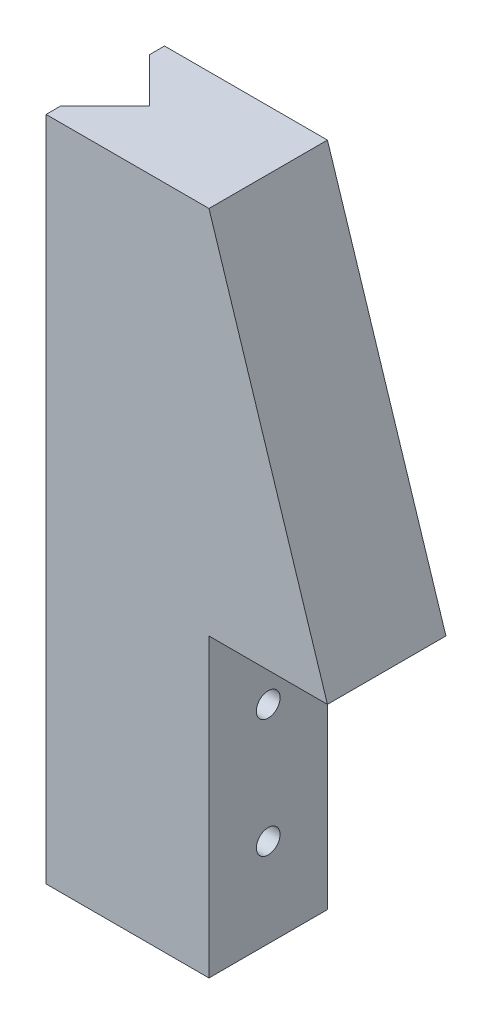
ISO-10303-21;
HEADER;
FILE_DESCRIPTION(('STEP AP214'),'2;1');
FILE_NAME('part.step','',(''),(''),'','','');
FILE_SCHEMA(('AUTOMOTIVE_DESIGN { 1 0 10303 214 1 1 1 1 }'));
ENDSEC;
DATA;
#1=APPLICATION_CONTEXT('core data for automotive mechanical design processes');
#2=APPLICATION_PROTOCOL_DEFINITION('international standard','automotive_design',2000,#1);
#3=PRODUCT_CONTEXT('',#1,'mechanical');
#4=PRODUCT('Part','Part','',(#3));
#5=PRODUCT_RELATED_PRODUCT_CATEGORY('part','',(#4));
#6=PRODUCT_DEFINITION_FORMATION('','',#4);
#7=PRODUCT_DEFINITION_CONTEXT('part definition',#1,'design');
#8=PRODUCT_DEFINITION('design','',#6,#7);
#9=PRODUCT_DEFINITION_SHAPE('','',#8);
#10=(LENGTH_UNIT() NAMED_UNIT(*) SI_UNIT(.MILLI.,.METRE.));
#11=(NAMED_UNIT(*) PLANE_ANGLE_UNIT() SI_UNIT($,.RADIAN.));
#12=(NAMED_UNIT(*) SI_UNIT($,.STERADIAN.) SOLID_ANGLE_UNIT());
#13=UNCERTAINTY_MEASURE_WITH_UNIT(LENGTH_MEASURE(1.E-05),#10,'distance_accuracy_value','');
#14=(GEOMETRIC_REPRESENTATION_CONTEXT(3) GLOBAL_UNCERTAINTY_ASSIGNED_CONTEXT((#13)) GLOBAL_UNIT_ASSIGNED_CONTEXT((#10,
#11,#12)) REPRESENTATION_CONTEXT('',''));
#15=CARTESIAN_POINT('',(0.,0.,0.));
#16=DIRECTION('',(0.,0.,1.));
#17=DIRECTION('',(1.,0.,0.));
#18=AXIS2_PLACEMENT_3D('',#15,#16,#17);
#19=CARTESIAN_POINT('',(-19.,-20.,8.));
#20=DIRECTION('',(1.,0.,0.));
#21=DIRECTION('',(0.,0.,-1.));
#22=AXIS2_PLACEMENT_3D('',#19,#20,#21);
#23=PLANE('',#22);
#24=DIRECTION('',(0.,0.,-1.));
#25=VECTOR('',#24,1.);
#26=CARTESIAN_POINT('',(-19.,-20.,8.));
#27=LINE('',#26,#25);
#28=CARTESIAN_POINT('',(-19.,-20.,1.));
#29=VERTEX_POINT('',#28);
#30=CARTESIAN_POINT('',(-19.,-20.,0.));
#31=VERTEX_POINT('',#30);
#32=EDGE_CURVE('E127',#29,#31,#27,.T.);
#33=ORIENTED_EDGE('',*,*,#32,.F.);
#34=DIRECTION('',(0.,1.,0.));
#35=VECTOR('',#34,1.);
#36=CARTESIAN_POINT('',(-19.,-20.,1.));
#37=LINE('',#36,#35);
#38=CARTESIAN_POINT('',(-19.,25.,1.));
#39=VERTEX_POINT('',#38);
#40=EDGE_CURVE('E140',#29,#39,#37,.T.);
#41=ORIENTED_EDGE('',*,*,#40,.T.);
#42=DIRECTION('',(0.,0.,-1.));
#43=VECTOR('',#42,1.);
#44=CARTESIAN_POINT('',(-19.,25.,8.));
#45=LINE('',#44,#43);
#46=CARTESIAN_POINT('',(-19.,25.,0.));
#47=VERTEX_POINT('',#46);
#48=EDGE_CURVE('E154',#39,#47,#45,.T.);
#49=ORIENTED_EDGE('',*,*,#48,.T.);
#50=DIRECTION('',(0.,-1.,0.));
#51=VECTOR('',#50,1.);
#52=CARTESIAN_POINT('',(-19.,-20.,0.));
#53=LINE('',#52,#51);
#54=EDGE_CURVE('E143',#47,#31,#53,.T.);
#55=ORIENTED_EDGE('',*,*,#54,.T.);
#56=EDGE_LOOP('',(#33,#41,#49,#55));
#57=FACE_BOUND('',#56,.T.);
#58=ADVANCED_FACE('F38',(#57),#23,.F.);
#59=CARTESIAN_POINT('',(-8.,25.,8.));
#60=DIRECTION('',(-0.952424147199324,-0.304775727103784,0.));
#61=DIRECTION('',(0.304775727103784,-0.952424147199324,0.));
#62=AXIS2_PLACEMENT_3D('',#59,#60,#61);
#63=PLANE('',#62);
#64=DIRECTION('',(-0.304775727103784,0.952424147199324,0.));
#65=VECTOR('',#64,1.);
#66=CARTESIAN_POINT('',(-8.,25.,0.));
#67=LINE('',#66,#65);
#68=CARTESIAN_POINT('',(0.,0.,0.));
#69=VERTEX_POINT('',#68);
#70=CARTESIAN_POINT('',(-8.,25.,0.));
#71=VERTEX_POINT('',#70);
#72=EDGE_CURVE('E136',#69,#71,#67,.T.);
#73=ORIENTED_EDGE('',*,*,#72,.T.);
#74=DIRECTION('',(0.,0.,-1.));
#75=VECTOR('',#74,1.);
#76=CARTESIAN_POINT('',(-8.,25.,8.));
#77=LINE('',#76,#75);
#78=CARTESIAN_POINT('',(-8.,25.,8.));
#79=VERTEX_POINT('',#78);
#80=EDGE_CURVE('E11',#79,#71,#77,.T.);
#81=ORIENTED_EDGE('',*,*,#80,.F.);
#82=DIRECTION('',(-0.304775727103784,0.952424147199324,0.));
#83=VECTOR('',#82,1.);
#84=CARTESIAN_POINT('',(-8.,25.,8.));
#85=LINE('',#84,#83);
#86=CARTESIAN_POINT('',(0.,0.,8.));
#87=VERTEX_POINT('',#86);
#88=EDGE_CURVE('E150',#87,#79,#85,.T.);
#89=ORIENTED_EDGE('',*,*,#88,.F.);
#90=DIRECTION('',(0.,0.,-1.));
#91=VECTOR('',#90,1.);
#92=CARTESIAN_POINT('',(0.,0.,8.));
#93=LINE('',#92,#91);
#94=EDGE_CURVE('E132',#87,#69,#93,.T.);
#95=ORIENTED_EDGE('',*,*,#94,.T.);
#96=EDGE_LOOP('',(#73,#81,#89,#95));
#97=FACE_BOUND('',#96,.T.);
#98=ADVANCED_FACE('F40',(#97),#63,.F.);
#99=CARTESIAN_POINT('',(-19.,25.,8.));
#100=DIRECTION('',(0.,-1.,0.));
#101=DIRECTION('',(0.,0.,-1.));
#102=AXIS2_PLACEMENT_3D('',#99,#100,#101);
#103=PLANE('',#102);
#104=ORIENTED_EDGE('',*,*,#48,.F.);
#105=DIRECTION('',(-0.707106781186554,0.,-0.707106781186541));
#106=VECTOR('',#105,1.);
#107=CARTESIAN_POINT('',(-19.,25.,1.));
#108=LINE('',#107,#106);
#109=CARTESIAN_POINT('',(-15.9999999999999,25.,4.));
#110=VERTEX_POINT('',#109);
#111=EDGE_CURVE('E182',#110,#39,#108,.T.);
#112=ORIENTED_EDGE('',*,*,#111,.F.);
#113=DIRECTION('',(0.707106781186541,0.,-0.707106781186554));
#114=VECTOR('',#113,1.);
#115=CARTESIAN_POINT('',(-15.9999999999999,25.,4.));
#116=LINE('',#115,#114);
#117=CARTESIAN_POINT('',(-19.,25.,7.0000000000001));
#118=VERTEX_POINT('',#117);
#119=EDGE_CURVE('E186',#118,#110,#116,.T.);
#120=ORIENTED_EDGE('',*,*,#119,.F.);
#121=CARTESIAN_POINT('',(-19.,25.,8.));
#122=VERTEX_POINT('',#121);
#123=EDGE_CURVE('E46',#122,#118,#45,.T.);
#124=ORIENTED_EDGE('',*,*,#123,.F.);
#125=DIRECTION('',(-1.,0.,0.));
#126=VECTOR('',#125,1.);
#127=CARTESIAN_POINT('',(-19.,25.,8.));
#128=LINE('',#127,#126);
#129=EDGE_CURVE('E97',#79,#122,#128,.T.);
#130=ORIENTED_EDGE('',*,*,#129,.F.);
#131=ORIENTED_EDGE('',*,*,#80,.T.);
#132=DIRECTION('',(-1.,0.,0.));
#133=VECTOR('',#132,1.);
#134=CARTESIAN_POINT('',(-19.,25.,0.));
#135=LINE('',#134,#133);
#136=EDGE_CURVE('E139',#71,#47,#135,.T.);
#137=ORIENTED_EDGE('',*,*,#136,.T.);
#138=EDGE_LOOP('',(#104,#112,#120,#124,#130,#131,#137));
#139=FACE_BOUND('',#138,.T.);
#140=ADVANCED_FACE('F165',(#139),#103,.F.);
#141=ORIENTED_EDGE('',*,*,#123,.T.);
#142=DIRECTION('',(0.,1.,0.));
#143=VECTOR('',#142,1.);
#144=CARTESIAN_POINT('',(-19.,-20.,7.0000000000001));
#145=LINE('',#144,#143);
#146=CARTESIAN_POINT('',(-19.,-20.,7.0000000000001));
#147=VERTEX_POINT('',#146);
#148=EDGE_CURVE('E176',#147,#118,#145,.T.);
#149=ORIENTED_EDGE('',*,*,#148,.F.);
#150=CARTESIAN_POINT('',(-19.,-20.,8.));
#151=VERTEX_POINT('',#150);
#152=EDGE_CURVE('E153',#151,#147,#27,.T.);
#153=ORIENTED_EDGE('',*,*,#152,.F.);
#154=DIRECTION('',(0.,-1.,0.));
#155=VECTOR('',#154,1.);
#156=CARTESIAN_POINT('',(-19.,-20.,8.));
#157=LINE('',#156,#155);
#158=EDGE_CURVE('E114',#122,#151,#157,.T.);
#159=ORIENTED_EDGE('',*,*,#158,.F.);
#160=EDGE_LOOP('',(#141,#149,#153,#159));
#161=FACE_BOUND('',#160,.T.);
#162=ADVANCED_FACE('F229',(#161),#23,.F.);
#163=CARTESIAN_POINT('',(-8.,-20.,8.));
#164=DIRECTION('',(0.,1.,0.));
#165=DIRECTION('',(-1.,0.,0.));
#166=AXIS2_PLACEMENT_3D('',#163,#164,#165);
#167=PLANE('',#166);
#168=DIRECTION('',(0.707106781186541,0.,-0.707106781186554));
#169=VECTOR('',#168,1.);
#170=CARTESIAN_POINT('',(-15.9999999999999,-20.,4.));
#171=LINE('',#170,#169);
#172=CARTESIAN_POINT('',(-15.9999999999999,-20.,4.));
#173=VERTEX_POINT('',#172);
#174=EDGE_CURVE('E185',#147,#173,#171,.T.);
#175=ORIENTED_EDGE('',*,*,#174,.T.);
#176=DIRECTION('',(-0.707106781186554,0.,-0.707106781186541));
#177=VECTOR('',#176,1.);
#178=CARTESIAN_POINT('',(-19.,-20.,1.));
#179=LINE('',#178,#177);
#180=EDGE_CURVE('E53',#173,#29,#179,.T.);
#181=ORIENTED_EDGE('',*,*,#180,.T.);
#182=ORIENTED_EDGE('',*,*,#32,.T.);
#183=DIRECTION('',(1.,0.,0.));
#184=VECTOR('',#183,1.);
#185=CARTESIAN_POINT('',(-8.,-20.,0.));
#186=LINE('',#185,#184);
#187=CARTESIAN_POINT('',(-8.,-20.,0.));
#188=VERTEX_POINT('',#187);
#189=EDGE_CURVE('E124',#31,#188,#186,.T.);
#190=ORIENTED_EDGE('',*,*,#189,.T.);
#191=DIRECTION('',(0.,0.,-1.));
#192=VECTOR('',#191,1.);
#193=CARTESIAN_POINT('',(-8.,-20.,8.));
#194=LINE('',#193,#192);
#195=CARTESIAN_POINT('',(-8.,-20.,8.));
#196=VERTEX_POINT('',#195);
#197=EDGE_CURVE('E120',#196,#188,#194,.T.);
#198=ORIENTED_EDGE('',*,*,#197,.F.);
#199=DIRECTION('',(1.,0.,0.));
#200=VECTOR('',#199,1.);
#201=CARTESIAN_POINT('',(-8.,-20.,8.));
#202=LINE('',#201,#200);
#203=EDGE_CURVE('E107',#151,#196,#202,.T.);
#204=ORIENTED_EDGE('',*,*,#203,.F.);
#205=ORIENTED_EDGE('',*,*,#152,.T.);
#206=EDGE_LOOP('',(#175,#181,#182,#190,#198,#204,#205));
#207=FACE_BOUND('',#206,.T.);
#208=ADVANCED_FACE('F122',(#207),#167,.F.);
#209=CARTESIAN_POINT('',(-8.,0.,8.));
#210=DIRECTION('',(-1.,0.,0.));
#211=DIRECTION('',(0.,0.,1.));
#212=AXIS2_PLACEMENT_3D('',#209,#210,#211);
#213=PLANE('',#212);
#214=CARTESIAN_POINT('',(-8.,-6.,4.));
#215=DIRECTION('',(1.,0.,0.));
#216=DIRECTION('',(0.,0.,-1.));
#217=AXIS2_PLACEMENT_3D('',#214,#215,#216);
#218=CIRCLE('',#217,0.79999999999999);
#219=CARTESIAN_POINT('',(-8.,-6.,3.20000000000001));
#220=VERTEX_POINT('',#219);
#221=EDGE_CURVE('E200',#220,#220,#218,.T.);
#222=ORIENTED_EDGE('',*,*,#221,.F.);
#223=EDGE_LOOP('',(#222));
#224=FACE_BOUND('',#223,.T.);
#225=CARTESIAN_POINT('',(-8.,-14.,4.));
#226=DIRECTION('',(1.,0.,0.));
#227=DIRECTION('',(0.,0.,-1.));
#228=AXIS2_PLACEMENT_3D('',#225,#226,#227);
#229=CIRCLE('',#228,0.79999999999999);
#230=CARTESIAN_POINT('',(-8.,-14.,3.20000000000001));
#231=VERTEX_POINT('',#230);
#232=EDGE_CURVE('E194',#231,#231,#229,.T.);
#233=ORIENTED_EDGE('',*,*,#232,.F.);
#234=EDGE_LOOP('',(#233));
#235=FACE_BOUND('',#234,.T.);
#236=DIRECTION('',(0.,1.,0.));
#237=VECTOR('',#236,1.);
#238=CARTESIAN_POINT('',(-8.,0.,0.));
#239=LINE('',#238,#237);
#240=CARTESIAN_POINT('',(-8.,0.,0.));
#241=VERTEX_POINT('',#240);
#242=EDGE_CURVE('E147',#188,#241,#239,.T.);
#243=ORIENTED_EDGE('',*,*,#242,.T.);
#244=DIRECTION('',(0.,0.,-1.));
#245=VECTOR('',#244,1.);
#246=CARTESIAN_POINT('',(-8.,0.,8.));
#247=LINE('',#246,#245);
#248=CARTESIAN_POINT('',(-8.,0.,8.));
#249=VERTEX_POINT('',#248);
#250=EDGE_CURVE('E128',#249,#241,#247,.T.);
#251=ORIENTED_EDGE('',*,*,#250,.F.);
#252=DIRECTION('',(0.,1.,0.));
#253=VECTOR('',#252,1.);
#254=CARTESIAN_POINT('',(-8.,0.,8.));
#255=LINE('',#254,#253);
#256=EDGE_CURVE('E111',#196,#249,#255,.T.);
#257=ORIENTED_EDGE('',*,*,#256,.F.);
#258=ORIENTED_EDGE('',*,*,#197,.T.);
#259=EDGE_LOOP('',(#243,#251,#257,#258));
#260=FACE_BOUND('',#259,.T.);
#261=ADVANCED_FACE('F130',(#224,#235,#260),#213,.F.);
#262=CARTESIAN_POINT('',(0.,0.,8.));
#263=DIRECTION('',(0.,1.,0.));
#264=DIRECTION('',(0.,0.,1.));
#265=AXIS2_PLACEMENT_3D('',#262,#263,#264);
#266=PLANE('',#265);
#267=DIRECTION('',(1.,0.,0.));
#268=VECTOR('',#267,1.);
#269=CARTESIAN_POINT('',(0.,0.,0.));
#270=LINE('',#269,#268);
#271=EDGE_CURVE('E89',#241,#69,#270,.T.);
#272=ORIENTED_EDGE('',*,*,#271,.T.);
#273=ORIENTED_EDGE('',*,*,#94,.F.);
#274=DIRECTION('',(1.,0.,0.));
#275=VECTOR('',#274,1.);
#276=CARTESIAN_POINT('',(0.,0.,8.));
#277=LINE('',#276,#275);
#278=EDGE_CURVE('E62',#249,#87,#277,.T.);
#279=ORIENTED_EDGE('',*,*,#278,.F.);
#280=ORIENTED_EDGE('',*,*,#250,.T.);
#281=EDGE_LOOP('',(#272,#273,#279,#280));
#282=FACE_BOUND('',#281,.T.);
#283=ADVANCED_FACE('F170',(#282),#266,.F.);
#284=CARTESIAN_POINT('',(0.,0.,8.));
#285=DIRECTION('',(0.,0.,-1.));
#286=DIRECTION('',(-1.,0.,0.));
#287=AXIS2_PLACEMENT_3D('',#284,#285,#286);
#288=PLANE('',#287);
#289=ORIENTED_EDGE('',*,*,#88,.T.);
#290=ORIENTED_EDGE('',*,*,#129,.T.);
#291=ORIENTED_EDGE('',*,*,#158,.T.);
#292=ORIENTED_EDGE('',*,*,#203,.T.);
#293=ORIENTED_EDGE('',*,*,#256,.T.);
#294=ORIENTED_EDGE('',*,*,#278,.T.);
#295=EDGE_LOOP('',(#289,#290,#291,#292,#293,#294));
#296=FACE_BOUND('',#295,.T.);
#297=ADVANCED_FACE('F109',(#296),#288,.F.);
#298=CARTESIAN_POINT('',(0.,0.,0.));
#299=DIRECTION('',(0.,0.,-1.));
#300=DIRECTION('',(-1.,0.,0.));
#301=AXIS2_PLACEMENT_3D('',#298,#299,#300);
#302=PLANE('',#301);
#303=ORIENTED_EDGE('',*,*,#72,.F.);
#304=ORIENTED_EDGE('',*,*,#271,.F.);
#305=ORIENTED_EDGE('',*,*,#242,.F.);
#306=ORIENTED_EDGE('',*,*,#189,.F.);
#307=ORIENTED_EDGE('',*,*,#54,.F.);
#308=ORIENTED_EDGE('',*,*,#136,.F.);
#309=EDGE_LOOP('',(#303,#304,#305,#306,#307,#308));
#310=FACE_BOUND('',#309,.T.);
#311=ADVANCED_FACE('F169',(#310),#302,.T.);
#312=CARTESIAN_POINT('',(-19.,-20.,1.));
#313=DIRECTION('',(0.707106781186541,0.,-0.707106781186553));
#314=DIRECTION('',(-0.707106781186554,0.,-0.707106781186542));
#315=AXIS2_PLACEMENT_3D('',#312,#313,#314);
#316=PLANE('',#315);
#317=ORIENTED_EDGE('',*,*,#111,.T.);
#318=ORIENTED_EDGE('',*,*,#40,.F.);
#319=ORIENTED_EDGE('',*,*,#180,.F.);
#320=DIRECTION('',(0.,1.,0.));
#321=VECTOR('',#320,1.);
#322=CARTESIAN_POINT('',(-15.9999999999999,-20.,4.));
#323=LINE('',#322,#321);
#324=EDGE_CURVE('E179',#173,#110,#323,.T.);
#325=ORIENTED_EDGE('',*,*,#324,.T.);
#326=EDGE_LOOP('',(#317,#318,#319,#325));
#327=FACE_BOUND('',#326,.T.);
#328=ADVANCED_FACE('F270',(#327),#316,.F.);
#329=CARTESIAN_POINT('',(-15.9999999999999,-20.,4.));
#330=DIRECTION('',(0.707106781186554,0.,0.707106781186541));
#331=DIRECTION('',(0.707106781186541,0.,-0.707106781186554));
#332=AXIS2_PLACEMENT_3D('',#329,#330,#331);
#333=PLANE('',#332);
#334=ORIENTED_EDGE('',*,*,#119,.T.);
#335=ORIENTED_EDGE('',*,*,#324,.F.);
#336=ORIENTED_EDGE('',*,*,#174,.F.);
#337=ORIENTED_EDGE('',*,*,#148,.T.);
#338=EDGE_LOOP('',(#334,#335,#336,#337));
#339=FACE_BOUND('',#338,.T.);
#340=ADVANCED_FACE('F223',(#339),#333,.F.);
#341=CARTESIAN_POINT('',(-13.,-14.,4.));
#342=DIRECTION('',(1.,0.,0.));
#343=DIRECTION('',(0.,0.,-1.));
#344=AXIS2_PLACEMENT_3D('',#341,#342,#343);
#345=CONICAL_SURFACE('',#344,0.799999999999999,1.02974425867665);
#346=CARTESIAN_POINT('',(-13.480688495222,-14.,4.));
#347=VERTEX_POINT('',#346);
#348=VERTEX_LOOP('',#347);
#349=FACE_BOUND('',#348,.T.);
#350=CARTESIAN_POINT('',(-13.,-14.,4.));
#351=DIRECTION('',(1.,0.,0.));
#352=DIRECTION('',(0.,0.,-1.));
#353=AXIS2_PLACEMENT_3D('',#350,#351,#352);
#354=CIRCLE('',#353,0.799999999999999);
#355=CARTESIAN_POINT('',(-13.,-14.,3.2));
#356=VERTEX_POINT('',#355);
#357=EDGE_CURVE('E189',#356,#356,#354,.T.);
#358=ORIENTED_EDGE('',*,*,#357,.T.);
#359=EDGE_LOOP('',(#358));
#360=FACE_BOUND('',#359,.T.);
#361=ADVANCED_FACE('F214',(#349,#360),#345,.F.);
#362=CARTESIAN_POINT('',(-8.,-14.,4.));
#363=DIRECTION('',(1.,0.,0.));
#364=DIRECTION('',(0.,0.,-1.));
#365=AXIS2_PLACEMENT_3D('',#362,#363,#364);
#366=CYLINDRICAL_SURFACE('',#365,0.799999999999994);
#367=ORIENTED_EDGE('',*,*,#357,.F.);
#368=EDGE_LOOP('',(#367));
#369=FACE_BOUND('',#368,.T.);
#370=ORIENTED_EDGE('',*,*,#232,.T.);
#371=EDGE_LOOP('',(#370));
#372=FACE_BOUND('',#371,.T.);
#373=ADVANCED_FACE('F211',(#369,#372),#366,.F.);
#374=CARTESIAN_POINT('',(-13.,-6.,4.));
#375=DIRECTION('',(1.,0.,0.));
#376=DIRECTION('',(0.,0.,-1.));
#377=AXIS2_PLACEMENT_3D('',#374,#375,#376);
#378=CONICAL_SURFACE('',#377,0.799999999999999,1.02974425867665);
#379=CARTESIAN_POINT('',(-13.480688495222,-6.,4.));
#380=VERTEX_POINT('',#379);
#381=VERTEX_LOOP('',#380);
#382=FACE_BOUND('',#381,.T.);
#383=CARTESIAN_POINT('',(-13.,-6.,4.));
#384=DIRECTION('',(1.,0.,0.));
#385=DIRECTION('',(0.,0.,-1.));
#386=AXIS2_PLACEMENT_3D('',#383,#384,#385);
#387=CIRCLE('',#386,0.799999999999999);
#388=CARTESIAN_POINT('',(-13.,-6.,3.2));
#389=VERTEX_POINT('',#388);
#390=EDGE_CURVE('E197',#389,#389,#387,.T.);
#391=ORIENTED_EDGE('',*,*,#390,.T.);
#392=EDGE_LOOP('',(#391));
#393=FACE_BOUND('',#392,.T.);
#394=ADVANCED_FACE('F213',(#382,#393),#378,.F.);
#395=CARTESIAN_POINT('',(-8.,-6.,4.));
#396=DIRECTION('',(1.,0.,0.));
#397=DIRECTION('',(0.,0.,-1.));
#398=AXIS2_PLACEMENT_3D('',#395,#396,#397);
#399=CYLINDRICAL_SURFACE('',#398,0.799999999999994);
#400=ORIENTED_EDGE('',*,*,#390,.F.);
#401=EDGE_LOOP('',(#400));
#402=FACE_BOUND('',#401,.T.);
#403=ORIENTED_EDGE('',*,*,#221,.T.);
#404=EDGE_LOOP('',(#403));
#405=FACE_BOUND('',#404,.T.);
#406=ADVANCED_FACE('F204',(#402,#405),#399,.F.);
#407=CLOSED_SHELL('',(#58,#98,#140,#162,#208,#261,#283,#297,#311,#328,#340,#361,#373,#394,#406));
#408=MANIFOLD_SOLID_BREP('B2',#407);
#409=ADVANCED_BREP_SHAPE_REPRESENTATION('',(#18,#408),#14);
#410=SHAPE_DEFINITION_REPRESENTATION(#9,#409);
ENDSEC;
END-ISO-10303-21;
